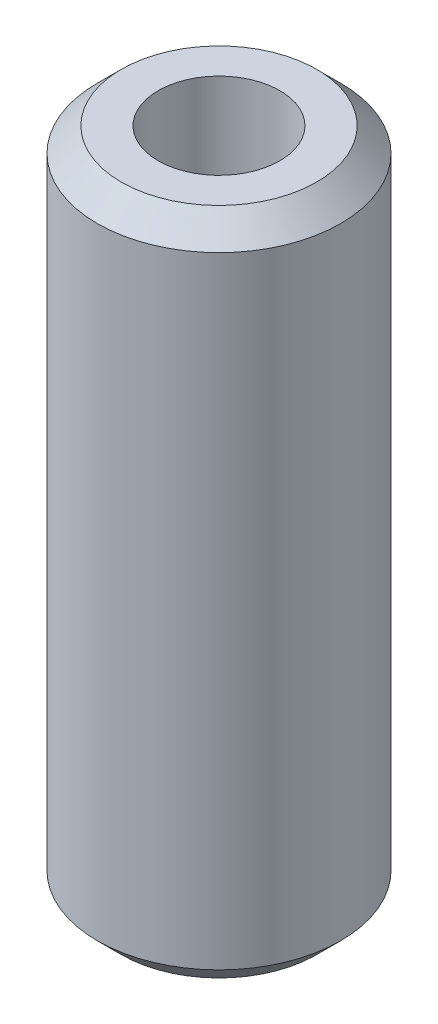
ISO-10303-21;
HEADER;
FILE_DESCRIPTION(('STEP AP214'),'2;1');
FILE_NAME('part.step','',(''),(''),'','','');
FILE_SCHEMA(('AUTOMOTIVE_DESIGN { 1 0 10303 214 1 1 1 1 }'));
ENDSEC;
DATA;
#1=APPLICATION_CONTEXT('core data for automotive mechanical design processes');
#2=APPLICATION_PROTOCOL_DEFINITION('international standard','automotive_design',2000,#1);
#3=PRODUCT_CONTEXT('',#1,'mechanical');
#4=PRODUCT('Part','Part','',(#3));
#5=PRODUCT_RELATED_PRODUCT_CATEGORY('part','',(#4));
#6=PRODUCT_DEFINITION_FORMATION('','',#4);
#7=PRODUCT_DEFINITION_CONTEXT('part definition',#1,'design');
#8=PRODUCT_DEFINITION('design','',#6,#7);
#9=PRODUCT_DEFINITION_SHAPE('','',#8);
#10=(LENGTH_UNIT() NAMED_UNIT(*) SI_UNIT(.MILLI.,.METRE.));
#11=(NAMED_UNIT(*) PLANE_ANGLE_UNIT() SI_UNIT($,.RADIAN.));
#12=(NAMED_UNIT(*) SI_UNIT($,.STERADIAN.) SOLID_ANGLE_UNIT());
#13=UNCERTAINTY_MEASURE_WITH_UNIT(LENGTH_MEASURE(1.E-05),#10,'distance_accuracy_value','');
#14=(GEOMETRIC_REPRESENTATION_CONTEXT(3) GLOBAL_UNCERTAINTY_ASSIGNED_CONTEXT((#13)) GLOBAL_UNIT_ASSIGNED_CONTEXT((#10,
#11,#12)) REPRESENTATION_CONTEXT('',''));
#15=CARTESIAN_POINT('',(0.,0.,0.));
#16=DIRECTION('',(0.,0.,1.));
#17=DIRECTION('',(1.,0.,0.));
#18=AXIS2_PLACEMENT_3D('',#15,#16,#17);
#19=CARTESIAN_POINT('',(0.,34.925,0.));
#20=DIRECTION('',(0.,1.,0.));
#21=DIRECTION('',(0.,0.,1.));
#22=AXIS2_PLACEMENT_3D('',#19,#20,#21);
#23=PLANE('',#22);
#24=CARTESIAN_POINT('',(0.,34.925,0.));
#25=DIRECTION('',(0.,1.,0.));
#26=DIRECTION('',(0.,0.,1.));
#27=AXIS2_PLACEMENT_3D('',#24,#25,#26);
#28=CIRCLE('',#27,10.2);
#29=CARTESIAN_POINT('',(0.,34.925,10.2));
#30=VERTEX_POINT('',#29);
#31=EDGE_CURVE('E10',#30,#30,#28,.T.);
#32=ORIENTED_EDGE('',*,*,#31,.T.);
#33=EDGE_LOOP('',(#32));
#34=FACE_BOUND('',#33,.T.);
#35=CARTESIAN_POINT('',(0.,34.925,0.));
#36=DIRECTION('',(0.,1.,0.));
#37=DIRECTION('',(0.,0.,1.));
#38=AXIS2_PLACEMENT_3D('',#35,#36,#37);
#39=CIRCLE('',#38,6.35);
#40=CARTESIAN_POINT('',(0.,34.925,6.35));
#41=VERTEX_POINT('',#40);
#42=EDGE_CURVE('E67',#41,#41,#39,.T.);
#43=ORIENTED_EDGE('',*,*,#42,.F.);
#44=EDGE_LOOP('',(#43));
#45=FACE_BOUND('',#44,.T.);
#46=ADVANCED_FACE('F42',(#34,#45),#23,.T.);
#47=CARTESIAN_POINT('',(0.,-34.925,0.));
#48=DIRECTION('',(0.,1.,0.));
#49=DIRECTION('',(0.,0.,1.));
#50=AXIS2_PLACEMENT_3D('',#47,#48,#49);
#51=PLANE('',#50);
#52=CARTESIAN_POINT('',(0.,-34.925,0.));
#53=DIRECTION('',(0.,1.,0.));
#54=DIRECTION('',(0.,0.,1.));
#55=AXIS2_PLACEMENT_3D('',#52,#53,#54);
#56=CIRCLE('',#55,10.2);
#57=CARTESIAN_POINT('',(0.,-34.925,10.2));
#58=VERTEX_POINT('',#57);
#59=EDGE_CURVE('E51',#58,#58,#56,.F.);
#60=ORIENTED_EDGE('',*,*,#59,.T.);
#61=EDGE_LOOP('',(#60));
#62=FACE_BOUND('',#61,.T.);
#63=CARTESIAN_POINT('',(0.,-34.925,0.));
#64=DIRECTION('',(0.,1.,0.));
#65=DIRECTION('',(0.,0.,1.));
#66=AXIS2_PLACEMENT_3D('',#63,#64,#65);
#67=CIRCLE('',#66,6.35);
#68=CARTESIAN_POINT('',(0.,-34.925,6.35));
#69=VERTEX_POINT('',#68);
#70=EDGE_CURVE('E68',#69,#69,#67,.T.);
#71=ORIENTED_EDGE('',*,*,#70,.T.);
#72=EDGE_LOOP('',(#71));
#73=FACE_BOUND('',#72,.T.);
#74=ADVANCED_FACE('F80',(#62,#73),#51,.F.);
#75=CARTESIAN_POINT('',(0.,34.925,0.));
#76=DIRECTION('',(0.,-1.,0.));
#77=DIRECTION('',(0.,0.,-1.));
#78=AXIS2_PLACEMENT_3D('',#75,#76,#77);
#79=CYLINDRICAL_SURFACE('',#78,12.7);
#80=CARTESIAN_POINT('',(0.,-32.425,0.));
#81=DIRECTION('',(0.,1.,0.));
#82=DIRECTION('',(0.,0.,1.));
#83=AXIS2_PLACEMENT_3D('',#80,#81,#82);
#84=CIRCLE('',#83,12.7);
#85=CARTESIAN_POINT('',(0.,-32.425,12.7));
#86=VERTEX_POINT('',#85);
#87=EDGE_CURVE('E56',#86,#86,#84,.T.);
#88=ORIENTED_EDGE('',*,*,#87,.T.);
#89=EDGE_LOOP('',(#88));
#90=FACE_BOUND('',#89,.T.);
#91=CARTESIAN_POINT('',(0.,32.425,0.));
#92=DIRECTION('',(0.,1.,0.));
#93=DIRECTION('',(0.,0.,1.));
#94=AXIS2_PLACEMENT_3D('',#91,#92,#93);
#95=CIRCLE('',#94,12.7);
#96=CARTESIAN_POINT('',(0.,32.425,12.7));
#97=VERTEX_POINT('',#96);
#98=EDGE_CURVE('E61',#97,#97,#95,.F.);
#99=ORIENTED_EDGE('',*,*,#98,.T.);
#100=EDGE_LOOP('',(#99));
#101=FACE_BOUND('',#100,.T.);
#102=ADVANCED_FACE('F85',(#90,#101),#79,.T.);
#103=CARTESIAN_POINT('',(0.,34.925,0.));
#104=DIRECTION('',(0.,-1.,0.));
#105=DIRECTION('',(0.,0.,-1.));
#106=AXIS2_PLACEMENT_3D('',#103,#104,#105);
#107=CYLINDRICAL_SURFACE('',#106,6.35);
#108=ORIENTED_EDGE('',*,*,#42,.T.);
#109=EDGE_LOOP('',(#108));
#110=FACE_BOUND('',#109,.T.);
#111=ORIENTED_EDGE('',*,*,#70,.F.);
#112=EDGE_LOOP('',(#111));
#113=FACE_BOUND('',#112,.T.);
#114=ADVANCED_FACE('F76',(#110,#113),#107,.F.);
#115=CARTESIAN_POINT('',(0.,-32.425,0.));
#116=DIRECTION('',(0.,1.,0.));
#117=DIRECTION('',(0.,0.,1.));
#118=AXIS2_PLACEMENT_3D('',#115,#116,#117);
#119=CONICAL_SURFACE('',#118,12.7,0.785398163397449);
#120=ORIENTED_EDGE('',*,*,#59,.F.);
#121=EDGE_LOOP('',(#120));
#122=FACE_BOUND('',#121,.T.);
#123=ORIENTED_EDGE('',*,*,#87,.F.);
#124=EDGE_LOOP('',(#123));
#125=FACE_BOUND('',#124,.T.);
#126=ADVANCED_FACE('F92',(#122,#125),#119,.T.);
#127=CARTESIAN_POINT('',(0.,34.925,0.));
#128=DIRECTION('',(0.,-1.,0.));
#129=DIRECTION('',(0.,0.,-1.));
#130=AXIS2_PLACEMENT_3D('',#127,#128,#129);
#131=CONICAL_SURFACE('',#130,10.2,0.785398163397446);
#132=ORIENTED_EDGE('',*,*,#98,.F.);
#133=EDGE_LOOP('',(#132));
#134=FACE_BOUND('',#133,.T.);
#135=ORIENTED_EDGE('',*,*,#31,.F.);
#136=EDGE_LOOP('',(#135));
#137=FACE_BOUND('',#136,.T.);
#138=ADVANCED_FACE('F45',(#134,#137),#131,.T.);
#139=CLOSED_SHELL('',(#46,#74,#102,#114,#126,#138));
#140=MANIFOLD_SOLID_BREP('B2',#139);
#141=ADVANCED_BREP_SHAPE_REPRESENTATION('',(#18,#140),#14);
#142=SHAPE_DEFINITION_REPRESENTATION(#9,#141);
ENDSEC;
END-ISO-10303-21;
